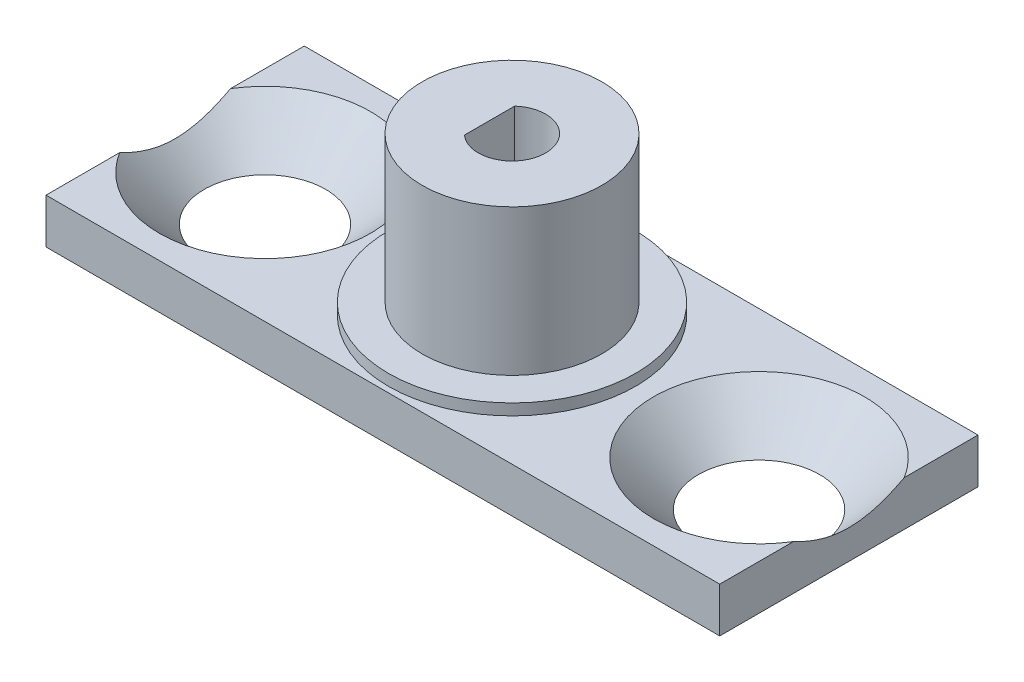
ISO-10303-21;
HEADER;
FILE_DESCRIPTION(('STEP AP214'),'2;1');
FILE_NAME('part.step','',(''),(''),'','','');
FILE_SCHEMA(('AUTOMOTIVE_DESIGN { 1 0 10303 214 1 1 1 1 }'));
ENDSEC;
DATA;
#1=APPLICATION_CONTEXT('core data for automotive mechanical design processes');
#2=APPLICATION_PROTOCOL_DEFINITION('international standard','automotive_design',2000,#1);
#3=PRODUCT_CONTEXT('',#1,'mechanical');
#4=PRODUCT('Part','Part','',(#3));
#5=PRODUCT_RELATED_PRODUCT_CATEGORY('part','',(#4));
#6=PRODUCT_DEFINITION_FORMATION('','',#4);
#7=PRODUCT_DEFINITION_CONTEXT('part definition',#1,'design');
#8=PRODUCT_DEFINITION('design','',#6,#7);
#9=PRODUCT_DEFINITION_SHAPE('','',#8);
#10=(LENGTH_UNIT() NAMED_UNIT(*) SI_UNIT(.MILLI.,.METRE.));
#11=(NAMED_UNIT(*) PLANE_ANGLE_UNIT() SI_UNIT($,.RADIAN.));
#12=(NAMED_UNIT(*) SI_UNIT($,.STERADIAN.) SOLID_ANGLE_UNIT());
#13=UNCERTAINTY_MEASURE_WITH_UNIT(LENGTH_MEASURE(1.E-05),#10,'distance_accuracy_value','');
#14=(GEOMETRIC_REPRESENTATION_CONTEXT(3) GLOBAL_UNCERTAINTY_ASSIGNED_CONTEXT((#13)) GLOBAL_UNIT_ASSIGNED_CONTEXT((#10,
#11,#12)) REPRESENTATION_CONTEXT('',''));
#15=CARTESIAN_POINT('',(0.,0.,0.));
#16=DIRECTION('',(0.,0.,1.));
#17=DIRECTION('',(1.,0.,0.));
#18=AXIS2_PLACEMENT_3D('',#15,#16,#17);
#19=CARTESIAN_POINT('',(0.,0.,0.));
#20=DIRECTION('',(0.,1.,0.));
#21=DIRECTION('',(0.,0.,1.));
#22=AXIS2_PLACEMENT_3D('',#19,#20,#21);
#23=PLANE('',#22);
#24=CARTESIAN_POINT('',(11.,0.,0.));
#25=DIRECTION('',(0.,1.,0.));
#26=DIRECTION('',(0.,0.,1.));
#27=AXIS2_PLACEMENT_3D('',#24,#25,#26);
#28=CIRCLE('',#27,2.7);
#29=CARTESIAN_POINT('',(11.,0.,2.7));
#30=VERTEX_POINT('',#29);
#31=EDGE_CURVE('E121',#30,#30,#28,.T.);
#32=ORIENTED_EDGE('',*,*,#31,.T.);
#33=EDGE_LOOP('',(#32));
#34=FACE_BOUND('',#33,.T.);
#35=CARTESIAN_POINT('',(-11.,0.,0.));
#36=DIRECTION('',(0.,1.,0.));
#37=DIRECTION('',(0.,0.,1.));
#38=AXIS2_PLACEMENT_3D('',#35,#36,#37);
#39=CIRCLE('',#38,2.7);
#40=CARTESIAN_POINT('',(-11.,0.,2.7));
#41=VERTEX_POINT('',#40);
#42=EDGE_CURVE('E268',#41,#41,#39,.T.);
#43=ORIENTED_EDGE('',*,*,#42,.T.);
#44=EDGE_LOOP('',(#43));
#45=FACE_BOUND('',#44,.T.);
#46=DIRECTION('',(0.,0.,1.));
#47=VECTOR('',#46,1.);
#48=CARTESIAN_POINT('',(-15.,0.,-5.75));
#49=LINE('',#48,#47);
#50=CARTESIAN_POINT('',(-15.,0.,-5.75));
#51=VERTEX_POINT('',#50);
#52=CARTESIAN_POINT('',(-15.,0.,5.75));
#53=VERTEX_POINT('',#52);
#54=EDGE_CURVE('E140',#51,#53,#49,.T.);
#55=ORIENTED_EDGE('',*,*,#54,.F.);
#56=DIRECTION('',(-1.,0.,0.));
#57=VECTOR('',#56,1.);
#58=CARTESIAN_POINT('',(-15.,0.,-5.75));
#59=LINE('',#58,#57);
#60=CARTESIAN_POINT('',(15.,0.,-5.75));
#61=VERTEX_POINT('',#60);
#62=EDGE_CURVE('E151',#61,#51,#59,.T.);
#63=ORIENTED_EDGE('',*,*,#62,.F.);
#64=DIRECTION('',(0.,0.,-1.));
#65=VECTOR('',#64,1.);
#66=CARTESIAN_POINT('',(15.,0.,-5.75));
#67=LINE('',#66,#65);
#68=CARTESIAN_POINT('',(15.,0.,5.75));
#69=VERTEX_POINT('',#68);
#70=EDGE_CURVE('E148',#69,#61,#67,.T.);
#71=ORIENTED_EDGE('',*,*,#70,.F.);
#72=DIRECTION('',(1.,0.,0.));
#73=VECTOR('',#72,1.);
#74=CARTESIAN_POINT('',(-15.,0.,5.75));
#75=LINE('',#74,#73);
#76=EDGE_CURVE('E144',#53,#69,#75,.T.);
#77=ORIENTED_EDGE('',*,*,#76,.F.);
#78=EDGE_LOOP('',(#55,#63,#71,#77));
#79=FACE_BOUND('',#78,.T.);
#80=ADVANCED_FACE('F39',(#34,#45,#79),#23,.F.);
#81=CARTESIAN_POINT('',(-15.,2.,-5.75));
#82=DIRECTION('',(1.,0.,0.));
#83=DIRECTION('',(0.,0.,-1.));
#84=AXIS2_PLACEMENT_3D('',#81,#82,#83);
#85=PLANE('',#84);
#86=DIRECTION('',(0.,0.,1.));
#87=VECTOR('',#86,1.);
#88=CARTESIAN_POINT('',(-15.,2.,-5.75));
#89=LINE('',#88,#87);
#90=CARTESIAN_POINT('',(-15.,2.,2.46779253585061));
#91=VERTEX_POINT('',#90);
#92=CARTESIAN_POINT('',(-15.,2.,5.75));
#93=VERTEX_POINT('',#92);
#94=EDGE_CURVE('E154',#91,#93,#89,.T.);
#95=ORIENTED_EDGE('',*,*,#94,.F.);
#96=CARTESIAN_POINT('',(-15.,4.98079994627634,-6.55703346146095));
#97=CARTESIAN_POINT('',(-15.,4.84850678919842,-6.40203742013519));
#98=CARTESIAN_POINT('',(-15.,4.7169175357442,-6.24643325627506));
#99=CARTESIAN_POINT('',(-15.,4.45551144503151,-5.93370165475931));
#100=CARTESIAN_POINT('',(-15.,4.32569489772054,-5.77657397493424));
#101=CARTESIAN_POINT('',(-15.,4.06735170822101,-5.45944555215033));
#102=CARTESIAN_POINT('',(-15.,3.93884019308951,-5.29943245539313));
#103=CARTESIAN_POINT('',(-15.,3.68459195795682,-4.97722969703069));
#104=CARTESIAN_POINT('',(-15.,3.55885505200391,-4.81504018246567));
#105=CARTESIAN_POINT('',(-15.,3.29762921035539,-4.47051532014915));
#106=CARTESIAN_POINT('',(-15.,3.16253452729579,-4.2878797130281));
#107=CARTESIAN_POINT('',(-15.,2.89800921665333,-3.91846313366675));
#108=CARTESIAN_POINT('',(-15.,2.76857989908804,-3.73168121755579));
#109=CARTESIAN_POINT('',(-15.,2.51783334207829,-3.35347425066442));
#110=CARTESIAN_POINT('',(-15.,2.39649410839303,-3.16206389278955));
#111=CARTESIAN_POINT('',(-15.,2.16460132103778,-2.77286847053669));
#112=CARTESIAN_POINT('',(-15.,2.05404158567608,-2.57508714731701));
#113=CARTESIAN_POINT('',(-15.,1.86741479590005,-2.20932751301623));
#114=CARTESIAN_POINT('',(-15.,1.7887624359838,-2.04268361822074));
#115=CARTESIAN_POINT('',(-15.,1.64493882876273,-1.70355156848876));
#116=CARTESIAN_POINT('',(-15.,1.57976962570256,-1.5310625319499));
#117=CARTESIAN_POINT('',(-15.,1.46850129072369,-1.18431998770915));
#118=CARTESIAN_POINT('',(-15.,1.4219897113751,-1.01020338133841));
#119=CARTESIAN_POINT('',(-15.,1.36803342158434,-0.745892959967972));
#120=CARTESIAN_POINT('',(-15.,1.35268460108614,-0.657284205892371));
#121=CARTESIAN_POINT('',(-15.,1.32764775627463,-0.479276838168824));
#122=CARTESIAN_POINT('',(-15.,1.31795885150135,-0.389878349570057));
#123=CARTESIAN_POINT('',(-15.,1.30188625172419,-0.175059195100562));
#124=CARTESIAN_POINT('',(-15.,1.29833737408532,-0.0494137240747601));
#125=CARTESIAN_POINT('',(-15.,1.30311043886276,0.20162115087874));
#126=CARTESIAN_POINT('',(-15.,1.31143085563998,0.327010585641976));
#127=CARTESIAN_POINT('',(-15.,1.33950072943034,0.57714640927333));
#128=CARTESIAN_POINT('',(-15.,1.359309383511,0.701886065310101));
#129=CARTESIAN_POINT('',(-15.,1.4093060865584,0.949258601045254));
#130=CARTESIAN_POINT('',(-15.,1.4394966547798,1.07189096180089));
#131=CARTESIAN_POINT('',(-15.,1.52691084697872,1.37768765167907));
#132=CARTESIAN_POINT('',(-15.,1.59002772264093,1.55916255928903));
#133=CARTESIAN_POINT('',(-15.,1.73208851305604,1.91579237755463));
#134=CARTESIAN_POINT('',(-15.,1.81104436971202,2.0909424012347));
#135=CARTESIAN_POINT('',(-15.,1.93875150434244,2.35026288543566));
#136=CARTESIAN_POINT('',(-15.,1.98314986347914,2.43662419344952));
#137=CARTESIAN_POINT('',(-15.,2.07454043945175,2.60796755087103));
#138=CARTESIAN_POINT('',(-15.,2.12153269204049,2.69294958124656));
#139=CARTESIAN_POINT('',(-15.,2.21772046455734,2.86160279037846));
#140=CARTESIAN_POINT('',(-15.,2.26691500831719,2.9452745281534));
#141=CARTESIAN_POINT('',(-15.,2.36722292560977,3.11145099658757));
#142=CARTESIAN_POINT('',(-15.,2.41833620495381,3.19395578425812));
#143=CARTESIAN_POINT('',(-15.,2.59794115845444,3.47743740269298));
#144=CARTESIAN_POINT('',(-15.,2.73060445295715,3.6757755711801));
#145=CARTESIAN_POINT('',(-15.,3.00306126226698,4.06751263517917));
#146=CARTESIAN_POINT('',(-15.,3.14285674732185,4.26091014346187));
#147=CARTESIAN_POINT('',(-15.,3.42781389983152,4.64397367027004));
#148=CARTESIAN_POINT('',(-15.,3.57298039425266,4.83363608541103));
#149=CARTESIAN_POINT('',(-15.,3.86724615903676,5.20984030199095));
#150=CARTESIAN_POINT('',(-15.,4.01634502252126,5.39638242304508));
#151=CARTESIAN_POINT('',(-15.,4.31816735292042,5.76770420995518));
#152=CARTESIAN_POINT('',(-15.,4.47090260332449,5.95247427514933));
#153=CARTESIAN_POINT('',(-15.,4.77878865829944,6.3199930423722));
#154=CARTESIAN_POINT('',(-15.,4.93393951566805,6.50274170006943));
#155=CARTESIAN_POINT('',(-15.,5.40209321307706,7.04833425171398));
#156=CARTESIAN_POINT('',(-15.,5.71795840372819,7.40872080538497));
#157=CARTESIAN_POINT('',(-15.,6.31702438710311,8.08253672416991));
#158=CARTESIAN_POINT('',(-15.,6.59966114338186,8.39647050718798));
#159=CARTESIAN_POINT('',(-15.,7.16787377443663,9.02174969014894));
#160=CARTESIAN_POINT('',(-15.,7.45345007532977,9.33309470265222));
#161=CARTESIAN_POINT('',(-15.,8.0246047476268,9.95143727332568));
#162=CARTESIAN_POINT('',(-15.,8.31016682830864,10.2584499076167));
#163=CARTESIAN_POINT('',(-15.,8.88291586430391,10.8708516827726));
#164=CARTESIAN_POINT('',(-15.,9.17010251410487,11.1762411092291));
#165=CARTESIAN_POINT('',(-15.,9.45789926850331,11.4810502404211));
#166=B_SPLINE_CURVE_WITH_KNOTS('',3,(#96,#97,#98,#99,#100,#101,#102,#103,#104,#105,#106,#107,
#108,#109,#110,#111,#112,#113,#114,#115,#116,#117,#118,#119,#120,#121,#122,#123,#124,#125,#126,
#127,#128,#129,#130,#131,#132,#133,#134,#135,#136,#137,#138,#139,#140,#141,#142,#143,#144,#145,
#146,#147,#148,#149,#150,#151,#152,#153,#154,#155,#156,#157,#158,#159,#160,#161,#162,#163,#164,
#165),.UNSPECIFIED.,.F.,.F.,(4,2,2,2,2,2,2,2,2,2,2,2,2,2,2,2,2,2,2,2,2,2,2,2,2,2,2,2,2,2,2,2,2,
2,4),(0.,0.611338527011484,1.22277587618685,1.83844129403711,2.45406532447504,3.13549497402793,
3.8170813688598,4.49673207089288,5.17599069416612,5.72836087947224,6.28081475094083,
6.82027593136918,7.08990305628815,7.3594882266684,7.73599058676703,8.11244455688205,
8.49085579034059,8.86935891318874,9.44471898564889,10.0205144960925,10.3117958618951,
10.6030812435675,10.8942387668545,11.1853820161702,11.9009768183094,12.6167703833327,
13.3332236555756,14.0496030856744,14.7687518060993,15.4879162670324,16.9254838062861,
18.1927231154345,19.460148786058,20.7180064133224,21.9756348730792),.UNSPECIFIED.);
#167=CARTESIAN_POINT('',(-15.,2.,-2.46779253585061));
#168=VERTEX_POINT('',#167);
#169=EDGE_CURVE('E55',#91,#168,#166,.F.);
#170=ORIENTED_EDGE('',*,*,#169,.T.);
#171=CARTESIAN_POINT('',(-15.,2.,-5.75));
#172=VERTEX_POINT('',#171);
#173=EDGE_CURVE('E133',#172,#168,#89,.T.);
#174=ORIENTED_EDGE('',*,*,#173,.F.);
#175=DIRECTION('',(0.,-1.,0.));
#176=VECTOR('',#175,1.);
#177=CARTESIAN_POINT('',(-15.,2.,-5.75));
#178=LINE('',#177,#176);
#179=EDGE_CURVE('E139',#172,#51,#178,.T.);
#180=ORIENTED_EDGE('',*,*,#179,.T.);
#181=ORIENTED_EDGE('',*,*,#54,.T.);
#182=DIRECTION('',(0.,-1.,0.));
#183=VECTOR('',#182,1.);
#184=CARTESIAN_POINT('',(-15.,2.,5.75));
#185=LINE('',#184,#183);
#186=EDGE_CURVE('E164',#93,#53,#185,.T.);
#187=ORIENTED_EDGE('',*,*,#186,.F.);
#188=EDGE_LOOP('',(#95,#170,#174,#180,#181,#187));
#189=FACE_BOUND('',#188,.T.);
#190=ADVANCED_FACE('F41',(#189),#85,.F.);
#191=CARTESIAN_POINT('',(-15.,2.,5.75));
#192=DIRECTION('',(0.,0.,-1.));
#193=DIRECTION('',(-1.,0.,0.));
#194=AXIS2_PLACEMENT_3D('',#191,#192,#193);
#195=PLANE('',#194);
#196=ORIENTED_EDGE('',*,*,#76,.T.);
#197=DIRECTION('',(0.,-1.,0.));
#198=VECTOR('',#197,1.);
#199=CARTESIAN_POINT('',(15.,2.,5.75));
#200=LINE('',#199,#198);
#201=CARTESIAN_POINT('',(15.,2.,5.75));
#202=VERTEX_POINT('',#201);
#203=EDGE_CURVE('E160',#202,#69,#200,.T.);
#204=ORIENTED_EDGE('',*,*,#203,.F.);
#205=DIRECTION('',(1.,0.,0.));
#206=VECTOR('',#205,1.);
#207=CARTESIAN_POINT('',(-15.,2.,5.75));
#208=LINE('',#207,#206);
#209=EDGE_CURVE('E128',#93,#202,#208,.T.);
#210=ORIENTED_EDGE('',*,*,#209,.F.);
#211=ORIENTED_EDGE('',*,*,#186,.T.);
#212=EDGE_LOOP('',(#196,#204,#210,#211));
#213=FACE_BOUND('',#212,.T.);
#214=ADVANCED_FACE('F218',(#213),#195,.F.);
#215=CARTESIAN_POINT('',(15.,2.,-5.75));
#216=DIRECTION('',(-1.,0.,0.));
#217=DIRECTION('',(0.,0.,1.));
#218=AXIS2_PLACEMENT_3D('',#215,#216,#217);
#219=PLANE('',#218);
#220=DIRECTION('',(0.,0.,-1.));
#221=VECTOR('',#220,1.);
#222=CARTESIAN_POINT('',(15.,2.,-5.75));
#223=LINE('',#222,#221);
#224=CARTESIAN_POINT('',(15.,2.,-2.46779253585061));
#225=VERTEX_POINT('',#224);
#226=CARTESIAN_POINT('',(15.,2.,-5.75));
#227=VERTEX_POINT('',#226);
#228=EDGE_CURVE('E117',#225,#227,#223,.T.);
#229=ORIENTED_EDGE('',*,*,#228,.F.);
#230=CARTESIAN_POINT('',(15.,4.98079994627634,-6.55703346146095));
#231=CARTESIAN_POINT('',(15.,4.84850678919843,-6.40203742013519));
#232=CARTESIAN_POINT('',(15.,4.7169175357442,-6.24643325627506));
#233=CARTESIAN_POINT('',(15.,4.45551144503151,-5.93370165475931));
#234=CARTESIAN_POINT('',(15.,4.32569489772054,-5.77657397493424));
#235=CARTESIAN_POINT('',(15.,4.06735170822101,-5.45944555215033));
#236=CARTESIAN_POINT('',(15.,3.93884019308951,-5.29943245539313));
#237=CARTESIAN_POINT('',(15.,3.68459195795682,-4.97722969703069));
#238=CARTESIAN_POINT('',(15.,3.55885505200391,-4.81504018246568));
#239=CARTESIAN_POINT('',(15.,3.29762921035539,-4.47051532014915));
#240=CARTESIAN_POINT('',(15.,3.16253452729579,-4.2878797130281));
#241=CARTESIAN_POINT('',(15.,2.89800921665333,-3.91846313366675));
#242=CARTESIAN_POINT('',(15.,2.76857989908805,-3.73168121755579));
#243=CARTESIAN_POINT('',(15.,2.51783334207829,-3.35347425066442));
#244=CARTESIAN_POINT('',(15.,2.39649410839303,-3.16206389278955));
#245=CARTESIAN_POINT('',(15.,2.16460132103778,-2.77286847053669));
#246=CARTESIAN_POINT('',(15.,2.05404158567608,-2.57508714731701));
#247=CARTESIAN_POINT('',(15.,1.86741479590005,-2.20932751301623));
#248=CARTESIAN_POINT('',(15.,1.7887624359838,-2.04268361822074));
#249=CARTESIAN_POINT('',(15.,1.64493882876273,-1.70355156848876));
#250=CARTESIAN_POINT('',(15.,1.57976962570257,-1.5310625319499));
#251=CARTESIAN_POINT('',(15.,1.4685012907237,-1.18431998770915));
#252=CARTESIAN_POINT('',(15.,1.4219897113751,-1.01020338133842));
#253=CARTESIAN_POINT('',(15.,1.36803342158434,-0.745892959967974));
#254=CARTESIAN_POINT('',(15.,1.35268460108614,-0.657284205892373));
#255=CARTESIAN_POINT('',(15.,1.32764775627463,-0.479276838168826));
#256=CARTESIAN_POINT('',(15.,1.31795885150135,-0.389878349570059));
#257=CARTESIAN_POINT('',(15.,1.30188625172419,-0.175059195100565));
#258=CARTESIAN_POINT('',(15.,1.29833737408532,-0.0494137240747632));
#259=CARTESIAN_POINT('',(15.,1.30311043886276,0.201621150878737));
#260=CARTESIAN_POINT('',(15.,1.31143085563998,0.327010585641973));
#261=CARTESIAN_POINT('',(15.,1.33950072943035,0.577146409273327));
#262=CARTESIAN_POINT('',(15.,1.359309383511,0.701886065310098));
#263=CARTESIAN_POINT('',(15.,1.4093060865584,0.949258601045252));
#264=CARTESIAN_POINT('',(15.,1.4394966547798,1.07189096180089));
#265=CARTESIAN_POINT('',(15.,1.52691084697872,1.37768765167907));
#266=CARTESIAN_POINT('',(15.,1.59002772264093,1.55916255928902));
#267=CARTESIAN_POINT('',(15.,1.73208851305603,1.91579237755463));
#268=CARTESIAN_POINT('',(15.,1.81104436971202,2.09094240123469));
#269=CARTESIAN_POINT('',(15.,1.93875150434244,2.35026288543565));
#270=CARTESIAN_POINT('',(15.,1.98314986347914,2.43662419344951));
#271=CARTESIAN_POINT('',(15.,2.07454043945174,2.60796755087103));
#272=CARTESIAN_POINT('',(15.,2.12153269204049,2.69294958124656));
#273=CARTESIAN_POINT('',(15.,2.21772046455734,2.86160279037846));
#274=CARTESIAN_POINT('',(15.,2.26691500831719,2.94527452815339));
#275=CARTESIAN_POINT('',(15.,2.36722292560977,3.11145099658757));
#276=CARTESIAN_POINT('',(15.,2.4183362049538,3.19395578425812));
#277=CARTESIAN_POINT('',(15.,2.59794115845443,3.47743740269297));
#278=CARTESIAN_POINT('',(15.,2.73060445295715,3.6757755711801));
#279=CARTESIAN_POINT('',(15.,3.00306126226697,4.06751263517916));
#280=CARTESIAN_POINT('',(15.,3.14285674732185,4.26091014346186));
#281=CARTESIAN_POINT('',(15.,3.42781389983151,4.64397367027003));
#282=CARTESIAN_POINT('',(15.,3.57298039425265,4.83363608541101));
#283=CARTESIAN_POINT('',(15.,3.86724615903675,5.20984030199093));
#284=CARTESIAN_POINT('',(15.,4.01634502252125,5.39638242304507));
#285=CARTESIAN_POINT('',(15.,4.31816735292041,5.76770420995516));
#286=CARTESIAN_POINT('',(15.,4.47090260332448,5.95247427514931));
#287=CARTESIAN_POINT('',(15.,4.77878865829943,6.31999304237219));
#288=CARTESIAN_POINT('',(15.,4.93393951566803,6.50274170006941));
#289=CARTESIAN_POINT('',(15.,5.40209321307704,7.04833425171396));
#290=CARTESIAN_POINT('',(15.,5.71795840372817,7.40872080538495));
#291=CARTESIAN_POINT('',(15.,6.31702438710309,8.08253672416989));
#292=CARTESIAN_POINT('',(15.,6.59966114338185,8.39647050718795));
#293=CARTESIAN_POINT('',(15.,7.16787377443661,9.02174969014891));
#294=CARTESIAN_POINT('',(15.,7.45345007532976,9.33309470265219));
#295=CARTESIAN_POINT('',(15.,8.02460474762678,9.95143727332565));
#296=CARTESIAN_POINT('',(15.,8.31016682830862,10.2584499076167));
#297=CARTESIAN_POINT('',(15.,8.88291586430388,10.8708516827725));
#298=CARTESIAN_POINT('',(15.,9.17010251410484,11.176241109229));
#299=CARTESIAN_POINT('',(15.,9.45789926850328,11.4810502404211));
#300=B_SPLINE_CURVE_WITH_KNOTS('',3,(#230,#231,#232,#233,#234,#235,#236,#237,#238,#239,#240,
#241,#242,#243,#244,#245,#246,#247,#248,#249,#250,#251,#252,#253,#254,#255,#256,#257,#258,#259,
#260,#261,#262,#263,#264,#265,#266,#267,#268,#269,#270,#271,#272,#273,#274,#275,#276,#277,#278,
#279,#280,#281,#282,#283,#284,#285,#286,#287,#288,#289,#290,#291,#292,#293,#294,#295,#296,#297,
#298,#299),.UNSPECIFIED.,.F.,.F.,(4,2,2,2,2,2,2,2,2,2,2,2,2,2,2,2,2,2,2,2,2,2,2,2,2,2,2,2,2,2,2,
2,2,2,4),(0.,0.611338527011482,1.22277587618685,1.83844129403711,2.45406532447504,
3.13549497402793,3.81708136885981,4.49673207089289,5.17599069416613,5.72836087947224,
6.28081475094083,6.82027593136918,7.08990305628815,7.3594882266684,7.73599058676703,
8.11244455688205,8.49085579034059,8.86935891318873,9.44471898564889,10.0205144960924,
10.3117958618951,10.6030812435675,10.8942387668545,11.1853820161702,11.9009768183094,
12.6167703833327,13.3332236555755,14.0496030856744,14.7687518060993,15.4879162670324,
16.9254838062861,18.1927231154345,19.460148786058,20.7180064133223,21.9756348730792),.UNSPECIFIED.);
#301=CARTESIAN_POINT('',(15.,2.,2.46779253585061));
#302=VERTEX_POINT('',#301);
#303=EDGE_CURVE('E11',#225,#302,#300,.T.);
#304=ORIENTED_EDGE('',*,*,#303,.T.);
#305=EDGE_CURVE('E119',#202,#302,#223,.T.);
#306=ORIENTED_EDGE('',*,*,#305,.F.);
#307=ORIENTED_EDGE('',*,*,#203,.T.);
#308=ORIENTED_EDGE('',*,*,#70,.T.);
#309=DIRECTION('',(0.,-1.,0.));
#310=VECTOR('',#309,1.);
#311=CARTESIAN_POINT('',(15.,2.,-5.75));
#312=LINE('',#311,#310);
#313=EDGE_CURVE('E125',#227,#61,#312,.T.);
#314=ORIENTED_EDGE('',*,*,#313,.F.);
#315=EDGE_LOOP('',(#229,#304,#306,#307,#308,#314));
#316=FACE_BOUND('',#315,.T.);
#317=ADVANCED_FACE('F123',(#316),#219,.F.);
#318=CARTESIAN_POINT('',(-15.,2.,-5.75));
#319=DIRECTION('',(0.,0.,1.));
#320=DIRECTION('',(1.,0.,0.));
#321=AXIS2_PLACEMENT_3D('',#318,#319,#320);
#322=PLANE('',#321);
#323=ORIENTED_EDGE('',*,*,#62,.T.);
#324=ORIENTED_EDGE('',*,*,#179,.F.);
#325=DIRECTION('',(-1.,0.,0.));
#326=VECTOR('',#325,1.);
#327=CARTESIAN_POINT('',(-15.,2.,-5.75));
#328=LINE('',#327,#326);
#329=EDGE_CURVE('E132',#227,#172,#328,.T.);
#330=ORIENTED_EDGE('',*,*,#329,.F.);
#331=ORIENTED_EDGE('',*,*,#313,.T.);
#332=EDGE_LOOP('',(#323,#324,#330,#331));
#333=FACE_BOUND('',#332,.T.);
#334=ADVANCED_FACE('F210',(#333),#322,.F.);
#335=CARTESIAN_POINT('',(0.,2.,0.));
#336=DIRECTION('',(0.,1.,0.));
#337=DIRECTION('',(0.,0.,1.));
#338=AXIS2_PLACEMENT_3D('',#335,#336,#337);
#339=PLANE('',#338);
#340=CARTESIAN_POINT('',(11.,2.,0.));
#341=DIRECTION('',(0.,1.,0.));
#342=DIRECTION('',(0.,0.,1.));
#343=AXIS2_PLACEMENT_3D('',#340,#341,#342);
#344=CIRCLE('',#343,4.7);
#345=EDGE_CURVE('E61',#225,#302,#344,.T.);
#346=ORIENTED_EDGE('',*,*,#345,.F.);
#347=ORIENTED_EDGE('',*,*,#228,.T.);
#348=ORIENTED_EDGE('',*,*,#329,.T.);
#349=ORIENTED_EDGE('',*,*,#173,.T.);
#350=CARTESIAN_POINT('',(-11.,2.,0.));
#351=DIRECTION('',(0.,1.,0.));
#352=DIRECTION('',(0.,0.,1.));
#353=AXIS2_PLACEMENT_3D('',#350,#351,#352);
#354=CIRCLE('',#353,4.7);
#355=EDGE_CURVE('E67',#91,#168,#354,.T.);
#356=ORIENTED_EDGE('',*,*,#355,.F.);
#357=ORIENTED_EDGE('',*,*,#94,.T.);
#358=ORIENTED_EDGE('',*,*,#209,.T.);
#359=ORIENTED_EDGE('',*,*,#305,.T.);
#360=EDGE_LOOP('',(#346,#347,#348,#349,#356,#357,#358,#359));
#361=FACE_BOUND('',#360,.T.);
#362=CARTESIAN_POINT('',(0.,2.,0.));
#363=DIRECTION('',(0.,1.,0.));
#364=DIRECTION('',(0.,0.,1.));
#365=AXIS2_PLACEMENT_3D('',#362,#363,#364);
#366=CIRCLE('',#365,5.5);
#367=CARTESIAN_POINT('',(0.,2.,5.5));
#368=VERTEX_POINT('',#367);
#369=EDGE_CURVE('E167',#368,#368,#366,.T.);
#370=ORIENTED_EDGE('',*,*,#369,.F.);
#371=EDGE_LOOP('',(#370));
#372=FACE_BOUND('',#371,.T.);
#373=ADVANCED_FACE('F115',(#361,#372),#339,.T.);
#374=CARTESIAN_POINT('',(0.,2.5,0.));
#375=DIRECTION('',(0.,-1.,0.));
#376=DIRECTION('',(0.,0.,-1.));
#377=AXIS2_PLACEMENT_3D('',#374,#375,#376);
#378=CYLINDRICAL_SURFACE('',#377,5.5);
#379=CARTESIAN_POINT('',(0.,2.5,0.));
#380=DIRECTION('',(0.,1.,0.));
#381=DIRECTION('',(0.,0.,1.));
#382=AXIS2_PLACEMENT_3D('',#379,#380,#381);
#383=CIRCLE('',#382,5.5);
#384=CARTESIAN_POINT('',(0.,2.5,5.5));
#385=VERTEX_POINT('',#384);
#386=EDGE_CURVE('E145',#385,#385,#383,.T.);
#387=ORIENTED_EDGE('',*,*,#386,.F.);
#388=EDGE_LOOP('',(#387));
#389=FACE_BOUND('',#388,.T.);
#390=ORIENTED_EDGE('',*,*,#369,.T.);
#391=EDGE_LOOP('',(#390));
#392=FACE_BOUND('',#391,.T.);
#393=ADVANCED_FACE('F203',(#389,#392),#378,.T.);
#394=CARTESIAN_POINT('',(0.,2.5,0.));
#395=DIRECTION('',(0.,1.,0.));
#396=DIRECTION('',(0.,0.,1.));
#397=AXIS2_PLACEMENT_3D('',#394,#395,#396);
#398=PLANE('',#397);
#399=CARTESIAN_POINT('',(0.,2.5,0.));
#400=DIRECTION('',(0.,1.,0.));
#401=DIRECTION('',(0.,0.,1.));
#402=AXIS2_PLACEMENT_3D('',#399,#400,#401);
#403=CIRCLE('',#402,4.);
#404=CARTESIAN_POINT('',(0.,2.5,4.));
#405=VERTEX_POINT('',#404);
#406=EDGE_CURVE('E174',#405,#405,#403,.T.);
#407=ORIENTED_EDGE('',*,*,#406,.F.);
#408=EDGE_LOOP('',(#407));
#409=FACE_BOUND('',#408,.T.);
#410=ORIENTED_EDGE('',*,*,#386,.T.);
#411=EDGE_LOOP('',(#410));
#412=FACE_BOUND('',#411,.T.);
#413=ADVANCED_FACE('F199',(#409,#412),#398,.T.);
#414=CARTESIAN_POINT('',(0.,9.,0.));
#415=DIRECTION('',(0.,-1.,0.));
#416=DIRECTION('',(0.,0.,-1.));
#417=AXIS2_PLACEMENT_3D('',#414,#415,#416);
#418=CYLINDRICAL_SURFACE('',#417,4.);
#419=CARTESIAN_POINT('',(0.,9.,0.));
#420=DIRECTION('',(0.,1.,0.));
#421=DIRECTION('',(0.,0.,1.));
#422=AXIS2_PLACEMENT_3D('',#419,#420,#421);
#423=CIRCLE('',#422,4.);
#424=CARTESIAN_POINT('',(0.,9.,4.));
#425=VERTEX_POINT('',#424);
#426=EDGE_CURVE('E245',#425,#425,#423,.T.);
#427=ORIENTED_EDGE('',*,*,#426,.F.);
#428=EDGE_LOOP('',(#427));
#429=FACE_BOUND('',#428,.T.);
#430=ORIENTED_EDGE('',*,*,#406,.T.);
#431=EDGE_LOOP('',(#430));
#432=FACE_BOUND('',#431,.T.);
#433=ADVANCED_FACE('F195',(#429,#432),#418,.T.);
#434=CARTESIAN_POINT('',(0.,9.,0.));
#435=DIRECTION('',(0.,1.,0.));
#436=DIRECTION('',(0.,0.,1.));
#437=AXIS2_PLACEMENT_3D('',#434,#435,#436);
#438=PLANE('',#437);
#439=CARTESIAN_POINT('',(0.,9.,0.));
#440=DIRECTION('',(0.,1.,0.));
#441=DIRECTION('',(0.,0.,1.));
#442=AXIS2_PLACEMENT_3D('',#439,#440,#441);
#443=CIRCLE('',#442,1.5);
#444=CARTESIAN_POINT('',(-1.,9.,1.1180339887499));
#445=VERTEX_POINT('',#444);
#446=CARTESIAN_POINT('',(-1.,9.,-1.1180339887499));
#447=VERTEX_POINT('',#446);
#448=EDGE_CURVE('E265',#445,#447,#443,.T.);
#449=ORIENTED_EDGE('',*,*,#448,.F.);
#450=DIRECTION('',(0.,0.,1.));
#451=VECTOR('',#450,1.);
#452=CARTESIAN_POINT('',(-1.,9.,-1.1180339887499));
#453=LINE('',#452,#451);
#454=EDGE_CURVE('E260',#447,#445,#453,.T.);
#455=ORIENTED_EDGE('',*,*,#454,.F.);
#456=EDGE_LOOP('',(#449,#455));
#457=FACE_BOUND('',#456,.T.);
#458=ORIENTED_EDGE('',*,*,#426,.T.);
#459=EDGE_LOOP('',(#458));
#460=FACE_BOUND('',#459,.T.);
#461=ADVANCED_FACE('F191',(#457,#460),#438,.T.);
#462=CARTESIAN_POINT('',(0.,2.,0.));
#463=DIRECTION('',(0.,1.,0.));
#464=DIRECTION('',(0.,0.,1.));
#465=AXIS2_PLACEMENT_3D('',#462,#463,#464);
#466=CYLINDRICAL_SURFACE('',#465,1.5);
#467=ORIENTED_EDGE('',*,*,#448,.T.);
#468=DIRECTION('',(0.,1.,0.));
#469=VECTOR('',#468,1.);
#470=CARTESIAN_POINT('',(-1.,2.,-1.1180339887499));
#471=LINE('',#470,#469);
#472=CARTESIAN_POINT('',(-1.,2.,-1.1180339887499));
#473=VERTEX_POINT('',#472);
#474=EDGE_CURVE('E253',#473,#447,#471,.T.);
#475=ORIENTED_EDGE('',*,*,#474,.F.);
#476=CARTESIAN_POINT('',(0.,2.,0.));
#477=DIRECTION('',(0.,1.,0.));
#478=DIRECTION('',(0.,0.,1.));
#479=AXIS2_PLACEMENT_3D('',#476,#477,#478);
#480=CIRCLE('',#479,1.5);
#481=CARTESIAN_POINT('',(-1.,2.,1.1180339887499));
#482=VERTEX_POINT('',#481);
#483=EDGE_CURVE('E264',#482,#473,#480,.T.);
#484=ORIENTED_EDGE('',*,*,#483,.F.);
#485=DIRECTION('',(0.,1.,0.));
#486=VECTOR('',#485,1.);
#487=CARTESIAN_POINT('',(-1.,2.,1.1180339887499));
#488=LINE('',#487,#486);
#489=EDGE_CURVE('E252',#482,#445,#488,.T.);
#490=ORIENTED_EDGE('',*,*,#489,.T.);
#491=EDGE_LOOP('',(#467,#475,#484,#490));
#492=FACE_BOUND('',#491,.T.);
#493=ADVANCED_FACE('F187',(#492),#466,.F.);
#494=CARTESIAN_POINT('',(-1.,2.,-1.1180339887499));
#495=DIRECTION('',(-1.,0.,0.));
#496=DIRECTION('',(0.,0.,1.));
#497=AXIS2_PLACEMENT_3D('',#494,#495,#496);
#498=PLANE('',#497);
#499=ORIENTED_EDGE('',*,*,#454,.T.);
#500=ORIENTED_EDGE('',*,*,#489,.F.);
#501=DIRECTION('',(0.,0.,1.));
#502=VECTOR('',#501,1.);
#503=CARTESIAN_POINT('',(-1.,2.,-1.1180339887499));
#504=LINE('',#503,#502);
#505=EDGE_CURVE('E257',#473,#482,#504,.T.);
#506=ORIENTED_EDGE('',*,*,#505,.F.);
#507=ORIENTED_EDGE('',*,*,#474,.T.);
#508=EDGE_LOOP('',(#499,#500,#506,#507));
#509=FACE_BOUND('',#508,.T.);
#510=ADVANCED_FACE('F183',(#509),#498,.F.);
#511=CARTESIAN_POINT('',(0.,2.,0.));
#512=DIRECTION('',(0.,1.,0.));
#513=DIRECTION('',(0.,0.,1.));
#514=AXIS2_PLACEMENT_3D('',#511,#512,#513);
#515=PLANE('',#514);
#516=ORIENTED_EDGE('',*,*,#483,.T.);
#517=ORIENTED_EDGE('',*,*,#505,.T.);
#518=EDGE_LOOP('',(#516,#517));
#519=FACE_BOUND('',#518,.T.);
#520=ADVANCED_FACE('F179',(#519),#515,.T.);
#521=CARTESIAN_POINT('',(-11.,2.,0.));
#522=DIRECTION('',(0.,1.,0.));
#523=DIRECTION('',(0.,0.,1.));
#524=AXIS2_PLACEMENT_3D('',#521,#522,#523);
#525=CONICAL_SURFACE('',#524,4.7,0.785398163397448);
#526=ORIENTED_EDGE('',*,*,#355,.T.);
#527=ORIENTED_EDGE('',*,*,#169,.F.);
#528=EDGE_LOOP('',(#526,#527));
#529=FACE_BOUND('',#528,.T.);
#530=ORIENTED_EDGE('',*,*,#42,.F.);
#531=EDGE_LOOP('',(#530));
#532=FACE_BOUND('',#531,.T.);
#533=ADVANCED_FACE('F175',(#529,#532),#525,.F.);
#534=CARTESIAN_POINT('',(11.,2.,0.));
#535=DIRECTION('',(0.,1.,0.));
#536=DIRECTION('',(0.,0.,1.));
#537=AXIS2_PLACEMENT_3D('',#534,#535,#536);
#538=CONICAL_SURFACE('',#537,4.7,0.785398163397448);
#539=ORIENTED_EDGE('',*,*,#345,.T.);
#540=ORIENTED_EDGE('',*,*,#303,.F.);
#541=EDGE_LOOP('',(#539,#540));
#542=FACE_BOUND('',#541,.T.);
#543=ORIENTED_EDGE('',*,*,#31,.F.);
#544=EDGE_LOOP('',(#543));
#545=FACE_BOUND('',#544,.T.);
#546=ADVANCED_FACE('F108',(#542,#545),#538,.F.);
#547=CLOSED_SHELL('',(#80,#190,#214,#317,#334,#373,#393,#413,#433,#461,#493,#510,#520,#533,#546));
#548=MANIFOLD_SOLID_BREP('B2',#547);
#549=ADVANCED_BREP_SHAPE_REPRESENTATION('',(#18,#548),#14);
#550=SHAPE_DEFINITION_REPRESENTATION(#9,#549);
ENDSEC;
END-ISO-10303-21;
